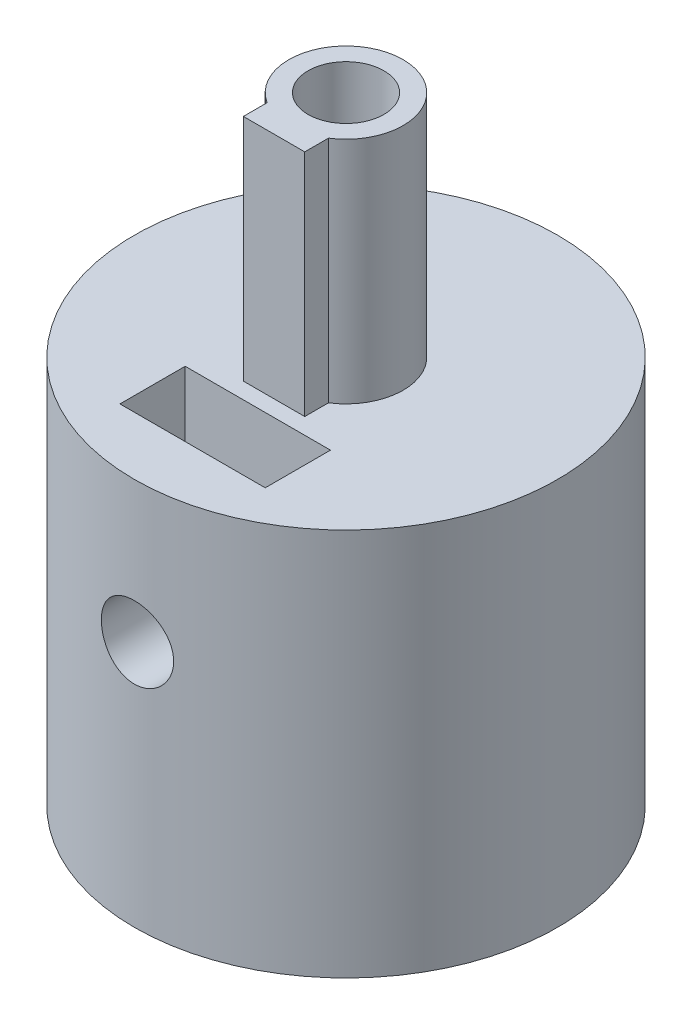
ISO-10303-21;
HEADER;
FILE_DESCRIPTION(('STEP AP214'),'2;1');
FILE_NAME('part.step','',(''),(''),'','','');
FILE_SCHEMA(('AUTOMOTIVE_DESIGN { 1 0 10303 214 1 1 1 1 }'));
ENDSEC;
DATA;
#1=APPLICATION_CONTEXT('core data for automotive mechanical design processes');
#2=APPLICATION_PROTOCOL_DEFINITION('international standard','automotive_design',2000,#1);
#3=PRODUCT_CONTEXT('',#1,'mechanical');
#4=PRODUCT('Part','Part','',(#3));
#5=PRODUCT_RELATED_PRODUCT_CATEGORY('part','',(#4));
#6=PRODUCT_DEFINITION_FORMATION('','',#4);
#7=PRODUCT_DEFINITION_CONTEXT('part definition',#1,'design');
#8=PRODUCT_DEFINITION('design','',#6,#7);
#9=PRODUCT_DEFINITION_SHAPE('','',#8);
#10=(LENGTH_UNIT() NAMED_UNIT(*) SI_UNIT(.MILLI.,.METRE.));
#11=(NAMED_UNIT(*) PLANE_ANGLE_UNIT() SI_UNIT($,.RADIAN.));
#12=(NAMED_UNIT(*) SI_UNIT($,.STERADIAN.) SOLID_ANGLE_UNIT());
#13=UNCERTAINTY_MEASURE_WITH_UNIT(LENGTH_MEASURE(1.E-05),#10,'distance_accuracy_value','');
#14=(GEOMETRIC_REPRESENTATION_CONTEXT(3) GLOBAL_UNCERTAINTY_ASSIGNED_CONTEXT((#13)) GLOBAL_UNIT_ASSIGNED_CONTEXT((#10,
#11,#12)) REPRESENTATION_CONTEXT('',''));
#15=CARTESIAN_POINT('',(0.,0.,0.));
#16=DIRECTION('',(0.,0.,1.));
#17=DIRECTION('',(1.,0.,0.));
#18=AXIS2_PLACEMENT_3D('',#15,#16,#17);
#19=CARTESIAN_POINT('',(0.,7.,6.));
#20=DIRECTION('',(0.,0.,-1.));
#21=DIRECTION('',(-1.,0.,0.));
#22=AXIS2_PLACEMENT_3D('',#19,#20,#21);
#23=CYLINDRICAL_SURFACE('',#22,1.025);
#24=CARTESIAN_POINT('',(-1.025,7.,1.8328597873269));
#25=CARTESIAN_POINT('',(-1.02499645606672,7.05360558498614,1.8328640935936));
#26=CARTESIAN_POINT('',(-1.02076698915576,7.10728326068248,1.83524689686831));
#27=CARTESIAN_POINT('',(-1.00405753177462,7.21300677697236,1.84443863790037));
#28=CARTESIAN_POINT('',(-0.991559385204819,7.26504876196016,1.85125731525541));
#29=CARTESIAN_POINT('',(-0.958969452031826,7.36577397405597,1.86834445087353));
#30=CARTESIAN_POINT('',(-0.938916546275438,7.41447291426796,1.87859521620438));
#31=CARTESIAN_POINT('',(-0.891904667350708,7.50780344562722,1.90136426661631));
#32=CARTESIAN_POINT('',(-0.86494560626241,7.55243498498397,1.91388258056418));
#33=CARTESIAN_POINT('',(-0.802406461176824,7.64023158224114,1.94097712724614));
#34=CARTESIAN_POINT('',(-0.76631621169833,7.68300737074963,1.95563775587243));
#35=CARTESIAN_POINT('',(-0.687601665544952,7.76219946830796,1.98468238424946));
#36=CARTESIAN_POINT('',(-0.644974255849895,7.79861272973073,1.99906624851168));
#37=CARTESIAN_POINT('',(-0.55108532396648,7.86630583536209,2.02702988673331));
#38=CARTESIAN_POINT('',(-0.499447438646705,7.89711293667531,2.04050061684691));
#39=CARTESIAN_POINT('',(-0.390941700361152,7.94942630968447,2.06403433745224));
#40=CARTESIAN_POINT('',(-0.334077021041106,7.97093818067812,2.0740993786814));
#41=CARTESIAN_POINT('',(-0.220850829971725,8.00252891838062,2.0890810601881));
#42=CARTESIAN_POINT('',(-0.164720524014055,8.01328866485981,2.09430254212573));
#43=CARTESIAN_POINT('',(-0.0512266882370234,8.02530565642908,2.10014221364635));
#44=CARTESIAN_POINT('',(0.00613611638643597,8.02656834386631,2.10076303966004));
#45=CARTESIAN_POINT('',(0.115373787896629,8.01983266517718,2.09748142204962));
#46=CARTESIAN_POINT('',(0.167309127918126,8.01259393861196,2.09394997215738));
#47=CARTESIAN_POINT('',(0.269118447664813,7.99041154600087,2.08331360243167));
#48=CARTESIAN_POINT('',(0.318992273374222,7.97546730539566,2.07620841612459));
#49=CARTESIAN_POINT('',(0.416153475149913,7.93818400144609,2.05895316401618));
#50=CARTESIAN_POINT('',(0.463393645521308,7.9157422120308,2.04876099467317));
#51=CARTESIAN_POINT('',(0.553555137985415,7.86423396018128,2.02626233951311));
#52=CARTESIAN_POINT('',(0.596474885223051,7.83516509459928,2.01395508711223));
#53=CARTESIAN_POINT('',(0.680950591937614,7.76817711605079,1.98706966262833));
#54=CARTESIAN_POINT('',(0.722025366910624,7.72969270677158,1.97238674800569));
#55=CARTESIAN_POINT('',(0.797390648207704,7.64648859549991,1.94314322644075));
#56=CARTESIAN_POINT('',(0.831676359665604,7.601764524395,1.92858271284636));
#57=CARTESIAN_POINT('',(0.894440298131244,7.50414319028026,1.90032382253067));
#58=CARTESIAN_POINT('',(0.922462951327314,7.45092130247636,1.88672531915229));
#59=CARTESIAN_POINT('',(0.96894590420928,7.33969400056835,1.86328435122403));
#60=CARTESIAN_POINT('',(0.987415779354138,7.28169344436965,1.8534381281014));
#61=CARTESIAN_POINT('',(1.01281094431499,7.16732297985472,1.83967626974392));
#62=CARTESIAN_POINT('',(1.02052340819776,7.11117795852812,1.83535842629193));
#63=CARTESIAN_POINT('',(1.02655429914469,6.99824263489739,1.83199386873751));
#64=CARTESIAN_POINT('',(1.02487867862491,6.94145276424609,1.8329438146448));
#65=CARTESIAN_POINT('',(1.01290336244989,6.83499386219216,1.83958207082482));
#66=CARTESIAN_POINT('',(1.00349913481734,6.78518854180321,1.84477807629652));
#67=CARTESIAN_POINT('',(0.97764080378385,6.68794853061936,1.85861017566643));
#68=CARTESIAN_POINT('',(0.961184545663605,6.64051456933413,1.8672473209342));
#69=CARTESIAN_POINT('',(0.920877212448492,6.54686680284666,1.88746229884837));
#70=CARTESIAN_POINT('',(0.896718260907304,6.50081191516395,1.8991580519879));
#71=CARTESIAN_POINT('',(0.841964328451562,6.41314809653428,1.92405824492246));
#72=CARTESIAN_POINT('',(0.811366070887821,6.37154144539512,1.93726345123587));
#73=CARTESIAN_POINT('',(0.740342279000107,6.28878007686261,1.96558410337199));
#74=CARTESIAN_POINT('',(0.699180694751609,6.24826794879975,1.98073991430063));
#75=CARTESIAN_POINT('',(0.610382766986842,6.1745372186658,2.00987952889889));
#76=CARTESIAN_POINT('',(0.562744561425935,6.14132072131622,2.02386299364009));
#77=CARTESIAN_POINT('',(0.46088365747209,6.08253549170786,2.04948776215532));
#78=CARTESIAN_POINT('',(0.406539905583027,6.05714957166641,2.06107126229387));
#79=CARTESIAN_POINT('',(0.293626072478352,6.01612584621076,2.08015652924546));
#80=CARTESIAN_POINT('',(0.235059573883659,6.0004798834219,2.08766171104581));
#81=CARTESIAN_POINT('',(0.120985244570837,5.98066877223898,2.097222972226));
#82=CARTESIAN_POINT('',(0.0656684200114449,5.97560656370893,2.09970419445187));
#83=CARTESIAN_POINT('',(-0.0450695482203042,5.97449692958199,2.10024529201488));
#84=CARTESIAN_POINT('',(-0.100490653193747,5.97844664221685,2.0983065709212));
#85=CARTESIAN_POINT('',(-0.206321200093286,5.99464010516335,2.09047330467869));
#86=CARTESIAN_POINT('',(-0.256830362999739,6.00636438807966,2.08482672187127));
#87=CARTESIAN_POINT('',(-0.355092191206429,6.03709509660264,2.07035688277301));
#88=CARTESIAN_POINT('',(-0.402844441603459,6.05610261503403,2.06153314977358));
#89=CARTESIAN_POINT('',(-0.496586623318674,6.1017440561972,2.04103045697026));
#90=CARTESIAN_POINT('',(-0.542406774569577,6.12867653213054,2.02924302326906));
#91=CARTESIAN_POINT('',(-0.629072329503909,6.18902245101638,2.00407282256472));
#92=CARTESIAN_POINT('',(-0.669915429297152,6.22243887699247,1.99068932236731));
#93=CARTESIAN_POINT('',(-0.749562379479786,6.29850472929795,1.96217008137833));
#94=CARTESIAN_POINT('',(-0.787801132441635,6.34173051599136,1.94698888727679));
#95=CARTESIAN_POINT('',(-0.856672139734532,6.43425655200169,1.91768544090081));
#96=CARTESIAN_POINT('',(-0.887298192258421,6.4835617053738,1.90356405851341));
#97=CARTESIAN_POINT('',(-0.940664590894157,6.58850827737924,1.87777865534351));
#98=CARTESIAN_POINT('',(-0.963192351888686,6.64427575689015,1.86618365252134));
#99=CARTESIAN_POINT('',(-0.998195400216386,6.75952106404816,1.84770353057538));
#100=CARTESIAN_POINT('',(-1.01070439407466,6.8189857191695,1.84080263081204));
#101=CARTESIAN_POINT('',(-1.02023257777911,6.89920162775227,1.83551880194986));
#102=CARTESIAN_POINT('',(-1.02201786408671,6.9193030196145,1.83452480173931));
#103=CARTESIAN_POINT('',(-1.0244022799265,6.95959952309683,1.83319446243567));
#104=CARTESIAN_POINT('',(-1.02500133580197,6.97979464045858,1.83285816418134));
#105=CARTESIAN_POINT('',(-1.025,7.,1.8328597873269));
#106=B_SPLINE_CURVE_WITH_KNOTS('',3,(#24,#25,#26,#27,#28,#29,#30,#31,#32,#33,#34,#35,#36,#37,
#38,#39,#40,#41,#42,#43,#44,#45,#46,#47,#48,#49,#50,#51,#52,#53,#54,#55,#56,#57,#58,#59,#60,#61,
#62,#63,#64,#65,#66,#67,#68,#69,#70,#71,#72,#73,#74,#75,#76,#77,#78,#79,#80,#81,#82,#83,#84,#85,
#86,#87,#88,#89,#90,#91,#92,#93,#94,#95,#96,#97,#98,#99,#100,#101,#102,#103,#104,#105),
.UNSPECIFIED.,.T.,.F.,(4,2,2,2,2,2,2,2,2,2,2,2,2,2,2,2,2,2,2,2,2,2,2,2,2,2,2,2,2,2,2,2,2,2,2,2,
2,2,2,2,4),(0.,0.160731801023402,0.32181770831564,0.482085661754884,0.642355655613302,
0.815190188583738,0.988107283055589,1.17200361229614,1.35578901037865,1.52701416065222,
1.69814118183609,1.85507088468206,2.01201229063649,2.17119877081237,2.33044306816614,
2.50420740726671,2.67809403541448,2.86212648314324,3.04597410221588,3.21550139929675,
3.38492122154889,3.53709084957253,3.68930700559683,3.8485908324795,4.00795590797556,
4.18627953834883,4.36465454605354,4.54692411187511,4.72904081783061,4.89496590268103,
5.06083830475238,5.216614525968,5.37241413003437,5.53506342110908,5.69778771924206,
5.87601659912541,6.05439020359654,6.23715299662205,6.41929830006472,6.47987859580963,
6.54046265305401),.UNSPECIFIED.);
#107=CARTESIAN_POINT('',(-1.025,7.,1.8328597873269));
#108=VERTEX_POINT('',#107);
#109=EDGE_CURVE('E245',#108,#108,#106,.T.);
#110=ORIENTED_EDGE('',*,*,#109,.T.);
#111=EDGE_LOOP('',(#110));
#112=FACE_BOUND('',#111,.T.);
#113=CARTESIAN_POINT('',(0.,7.,2.5));
#114=DIRECTION('',(0.,0.,1.));
#115=DIRECTION('',(1.,0.,0.));
#116=AXIS2_PLACEMENT_3D('',#113,#114,#115);
#117=CIRCLE('',#116,1.025);
#118=CARTESIAN_POINT('',(1.025,7.,2.5));
#119=VERTEX_POINT('',#118);
#120=EDGE_CURVE('E155',#119,#119,#117,.T.);
#121=ORIENTED_EDGE('',*,*,#120,.T.);
#122=EDGE_LOOP('',(#121));
#123=FACE_BOUND('',#122,.T.);
#124=ADVANCED_FACE('F50',(#112,#123),#23,.F.);
#125=CARTESIAN_POINT('',(0.,7.,4.35));
#126=DIRECTION('',(0.,0.,1.));
#127=DIRECTION('',(1.,0.,0.));
#128=AXIS2_PLACEMENT_3D('',#125,#126,#127);
#129=CIRCLE('',#128,1.025);
#130=CARTESIAN_POINT('',(1.025,7.,4.35));
#131=VERTEX_POINT('',#130);
#132=EDGE_CURVE('E187',#131,#131,#129,.T.);
#133=ORIENTED_EDGE('',*,*,#132,.F.);
#134=EDGE_LOOP('',(#133));
#135=FACE_BOUND('',#134,.T.);
#136=CARTESIAN_POINT('',(0.,5.975,6.));
#137=CARTESIAN_POINT('',(0.057129021805909,5.97500227159279,5.99999900775209));
#138=CARTESIAN_POINT('',(0.114288694426547,5.97979231886448,5.99917558388442));
#139=CARTESIAN_POINT('',(0.227003440677617,5.99881714817356,5.99597008814761));
#140=CARTESIAN_POINT('',(0.282557014382193,6.01306047901298,5.99358660551168));
#141=CARTESIAN_POINT('',(0.390412628331851,6.05054806685612,5.98752819489086));
#142=CARTESIAN_POINT('',(0.442717339459975,6.07378481362337,5.98385434470439));
#143=CARTESIAN_POINT('',(0.542679246717537,6.12857963716053,5.97561861890346));
#144=CARTESIAN_POINT('',(0.590336943676343,6.16013681583965,5.97105683914425));
#145=CARTESIAN_POINT('',(0.680135984205956,6.23101303674859,5.96149941501592));
#146=CARTESIAN_POINT('',(0.72222399560624,6.2703991817316,5.95650024504773));
#147=CARTESIAN_POINT('',(0.799228119899926,6.35567088546398,5.94665830480908));
#148=CARTESIAN_POINT('',(0.834143768661819,6.40155686450035,5.94181554467714));
#149=CARTESIAN_POINT('',(0.896027332048902,6.49889409366529,5.93280057753614));
#150=CARTESIAN_POINT('',(0.922942217268116,6.55037951664323,5.92863292447034));
#151=CARTESIAN_POINT('',(0.967721056978087,6.65722387590288,5.92148911657744));
#152=CARTESIAN_POINT('',(0.985585654718975,6.71258253657542,5.91851287707366));
#153=CARTESIAN_POINT('',(1.01158816944722,6.82503555386873,5.91412405211724));
#154=CARTESIAN_POINT('',(1.01981834503951,6.88210798803129,5.91269664496829));
#155=CARTESIAN_POINT('',(1.0266045006465,6.9968402184026,5.91152229524133));
#156=CARTESIAN_POINT('',(1.02516119995253,7.05449997062176,5.91177522771819));
#157=CARTESIAN_POINT('',(1.01271645572348,7.16810963916741,5.91391945370944));
#158=CARTESIAN_POINT('',(1.00181889187027,7.22407131955075,5.91579294055823));
#159=CARTESIAN_POINT('',(0.970938095258371,7.33336017378392,5.92093928903694));
#160=CARTESIAN_POINT('',(0.950954536531984,7.38668725303911,5.92421220087215));
#161=CARTESIAN_POINT('',(0.902364407216009,7.48950278148695,5.9318077416241));
#162=CARTESIAN_POINT('',(0.873714928690604,7.53897055247647,5.93613557261378));
#163=CARTESIAN_POINT('',(0.808636654316059,7.63243593173504,5.94534973658277));
#164=CARTESIAN_POINT('',(0.772207199569996,7.67643307618953,5.95023611685009));
#165=CARTESIAN_POINT('',(0.692038211440464,7.7583093808357,5.96009492603012));
#166=CARTESIAN_POINT('',(0.648209602257906,7.79610134182538,5.96506764647446));
#167=CARTESIAN_POINT('',(0.554787084587539,7.86380798444508,5.97448004062525));
#168=CARTESIAN_POINT('',(0.505193135382295,7.89372261043695,5.9789197105666));
#169=CARTESIAN_POINT('',(0.401564028575203,7.94483428225191,5.9867725569888));
#170=CARTESIAN_POINT('',(0.347524867685226,7.96602336454416,5.99018479500469));
#171=CARTESIAN_POINT('',(0.236583435115326,7.99900016984926,5.99559083662011));
#172=CARTESIAN_POINT('',(0.179681415700387,8.01078871966679,5.9975847649625));
#173=CARTESIAN_POINT('',(0.0653808172994139,8.0245110141699,5.99991268288137));
#174=CARTESIAN_POINT('',(0.00799700058598802,8.02656442072077,6.00026682699029));
#175=CARTESIAN_POINT('',(-0.106294577579117,8.02107753684309,5.99933056568816));
#176=CARTESIAN_POINT('',(-0.163202358214687,8.01353763491065,5.99804022687302));
#177=CARTESIAN_POINT('',(-0.274554949336556,7.98917768850822,5.99397247481089));
#178=CARTESIAN_POINT('',(-0.329013153116637,7.97241713634539,5.99120459810796));
#179=CARTESIAN_POINT('',(-0.434346698407184,7.93015526362798,5.98449086136286));
#180=CARTESIAN_POINT('',(-0.485221830138068,7.90465343180611,5.98054493241952));
#181=CARTESIAN_POINT('',(-0.582463116175228,7.84536060553919,5.97186273771382));
#182=CARTESIAN_POINT('',(-0.628783248246281,7.81149517401115,5.96711950406798));
#183=CARTESIAN_POINT('',(-0.71512583678395,7.73653853726443,5.95738922262263));
#184=CARTESIAN_POINT('',(-0.755147810705169,7.69544677889716,5.95240215617974));
#185=CARTESIAN_POINT('',(-0.828203708504392,7.60666625255827,5.94268078613609));
#186=CARTESIAN_POINT('',(-0.861156622624258,7.55891039765039,5.93794983407302));
#187=CARTESIAN_POINT('',(-0.918572497304515,7.45847068124877,5.92933984229212));
#188=CARTESIAN_POINT('',(-0.943035736678585,7.405786981665,5.92546077459866));
#189=CARTESIAN_POINT('',(-0.982657874256186,7.29720959133165,5.91901912534323));
#190=CARTESIAN_POINT('',(-0.997856483411738,7.24133073996123,5.91645093279999));
#191=CARTESIAN_POINT('',(-1.01864245502096,7.12776549602982,5.91290796951349));
#192=CARTESIAN_POINT('',(-1.02423069968971,7.07007926987783,5.91193305251065));
#193=CARTESIAN_POINT('',(-1.02561176041543,6.95534616736625,5.91169354428849));
#194=CARTESIAN_POINT('',(-1.02153213625353,6.89830083303665,5.91240668041866));
#195=CARTESIAN_POINT('',(-1.00396974898029,6.78572114096178,5.91541400302865));
#196=CARTESIAN_POINT('',(-0.990487020878766,6.73018677759163,5.91770818362188));
#197=CARTESIAN_POINT('',(-0.954550985092882,6.62225846829186,5.92361045759366));
#198=CARTESIAN_POINT('',(-0.932109203860776,6.56986058628411,5.92721686217777));
#199=CARTESIAN_POINT('',(-0.878905351085741,6.46955298770945,5.9353387767073));
#200=CARTESIAN_POINT('',(-0.848142832774206,6.42164351232635,5.93985433546496));
#201=CARTESIAN_POINT('',(-0.778717727996034,6.33102925911754,5.94935610169176));
#202=CARTESIAN_POINT('',(-0.739961482891464,6.28839676959398,5.95434747238202));
#203=CARTESIAN_POINT('',(-0.655846210332252,6.21019692843759,5.96419777785053));
#204=CARTESIAN_POINT('',(-0.610485663211635,6.17463120735148,5.96905668184154));
#205=CARTESIAN_POINT('',(-0.514055463609574,6.11133628404459,5.9781357643754));
#206=CARTESIAN_POINT('',(-0.462946585113283,6.08366612876151,5.98235102595813));
#207=CARTESIAN_POINT('',(-0.356753960873555,6.03734716959931,5.98962003307112));
#208=CARTESIAN_POINT('',(-0.301674193065421,6.01868947770605,5.99267492231261));
#209=CARTESIAN_POINT('',(-0.205324889668461,5.99492526014144,5.99662063052046));
#210=CARTESIAN_POINT('',(-0.164634720196102,5.98746540481212,5.99788104819846));
#211=CARTESIAN_POINT('',(-0.0826350389649354,5.97750199932918,5.99957108407766));
#212=CARTESIAN_POINT('',(-0.0413255387647288,5.97499835679322,6.00000071776442));
#213=CARTESIAN_POINT('',(0.,5.975,6.));
#214=B_SPLINE_CURVE_WITH_KNOTS('',3,(#136,#137,#138,#139,#140,#141,#142,#143,#144,#145,#146,
#147,#148,#149,#150,#151,#152,#153,#154,#155,#156,#157,#158,#159,#160,#161,#162,#163,#164,#165,
#166,#167,#168,#169,#170,#171,#172,#173,#174,#175,#176,#177,#178,#179,#180,#181,#182,#183,#184,
#185,#186,#187,#188,#189,#190,#191,#192,#193,#194,#195,#196,#197,#198,#199,#200,#201,#202,#203,
#204,#205,#206,#207,#208,#209,#210,#211,#212,#213),.UNSPECIFIED.,.T.,.F.,(4,2,2,2,2,2,2,2,2,2,2,
2,2,2,2,2,2,2,2,2,2,2,2,2,2,2,2,2,2,2,2,2,2,2,2,2,2,2,4),(0.,0.171235994893447,
0.342627053456379,0.513875294237686,0.685105058388228,0.857871180813245,1.03064847960544,
1.20454664979448,1.37843245841822,1.55063916189725,1.72283306073277,1.89315858532088,
2.06349022096238,2.23467942944234,2.40588314192621,2.57931792140326,2.75275392582942,
2.92634787091466,3.0999265462136,3.27136600700557,3.44279852530835,3.61313770472599,
3.78348684878489,3.95541050932786,4.12734733572354,4.30116013270972,4.4749672208821,
4.64802398347102,4.82106485889599,4.99183533604723,5.16260517738581,5.33315601574305,
5.50371601337198,5.67640118185052,5.84912614859001,6.023110871722,6.19692366051839,
6.32079330552967,6.44466064162598),.UNSPECIFIED.);
#215=CARTESIAN_POINT('',(0.,5.975,6.));
#216=VERTEX_POINT('',#215);
#217=EDGE_CURVE('E252',#216,#216,#214,.T.);
#218=ORIENTED_EDGE('',*,*,#217,.T.);
#219=EDGE_LOOP('',(#218));
#220=FACE_BOUND('',#219,.T.);
#221=ADVANCED_FACE('F263',(#135,#220),#23,.F.);
#222=CARTESIAN_POINT('',(0.,10.,0.));
#223=DIRECTION('',(0.,-1.,0.));
#224=DIRECTION('',(0.,0.,-1.));
#225=AXIS2_PLACEMENT_3D('',#222,#223,#224);
#226=CYLINDRICAL_SURFACE('',#225,6.);
#227=CARTESIAN_POINT('',(0.,0.,0.));
#228=DIRECTION('',(0.,1.,0.));
#229=DIRECTION('',(0.,0.,1.));
#230=AXIS2_PLACEMENT_3D('',#227,#228,#229);
#231=CIRCLE('',#230,6.);
#232=CARTESIAN_POINT('',(0.,0.,6.));
#233=VERTEX_POINT('',#232);
#234=EDGE_CURVE('E249',#233,#233,#231,.T.);
#235=ORIENTED_EDGE('',*,*,#234,.T.);
#236=EDGE_LOOP('',(#235));
#237=FACE_BOUND('',#236,.T.);
#238=ORIENTED_EDGE('',*,*,#217,.F.);
#239=EDGE_LOOP('',(#238));
#240=FACE_BOUND('',#239,.T.);
#241=CARTESIAN_POINT('',(0.,11.,0.));
#242=DIRECTION('',(0.,1.,0.));
#243=DIRECTION('',(0.,0.,1.));
#244=AXIS2_PLACEMENT_3D('',#241,#242,#243);
#245=CIRCLE('',#244,6.);
#246=CARTESIAN_POINT('',(0.,11.,6.));
#247=VERTEX_POINT('',#246);
#248=EDGE_CURVE('E222',#247,#247,#245,.T.);
#249=ORIENTED_EDGE('',*,*,#248,.F.);
#250=EDGE_LOOP('',(#249));
#251=FACE_BOUND('',#250,.T.);
#252=ADVANCED_FACE('F52',(#237,#240,#251),#226,.T.);
#253=CARTESIAN_POINT('',(0.,0.,0.));
#254=DIRECTION('',(0.,1.,0.));
#255=DIRECTION('',(0.,0.,1.));
#256=AXIS2_PLACEMENT_3D('',#253,#254,#255);
#257=PLANE('',#256);
#258=CARTESIAN_POINT('',(0.,0.,0.));
#259=DIRECTION('',(0.,1.,0.));
#260=DIRECTION('',(0.,0.,1.));
#261=AXIS2_PLACEMENT_3D('',#258,#259,#260);
#262=CIRCLE('',#261,2.1);
#263=CARTESIAN_POINT('',(0.,0.,2.1));
#264=VERTEX_POINT('',#263);
#265=EDGE_CURVE('E237',#264,#264,#262,.T.);
#266=ORIENTED_EDGE('',*,*,#265,.T.);
#267=EDGE_LOOP('',(#266));
#268=FACE_BOUND('',#267,.T.);
#269=ORIENTED_EDGE('',*,*,#234,.F.);
#270=EDGE_LOOP('',(#269));
#271=FACE_BOUND('',#270,.T.);
#272=ADVANCED_FACE('F270',(#268,#271),#257,.F.);
#273=CARTESIAN_POINT('',(0.,10.,0.));
#274=DIRECTION('',(0.,-1.,0.));
#275=DIRECTION('',(0.,0.,-1.));
#276=AXIS2_PLACEMENT_3D('',#273,#274,#275);
#277=CYLINDRICAL_SURFACE('',#276,2.1);
#278=DIRECTION('',(0.,-1.,0.));
#279=VECTOR('',#278,1.);
#280=CARTESIAN_POINT('',(0.475,10.,2.04557449143266));
#281=LINE('',#280,#279);
#282=CARTESIAN_POINT('',(0.475,10.,2.04557449143266));
#283=VERTEX_POINT('',#282);
#284=CARTESIAN_POINT('',(0.475,8.8,2.04557449143266));
#285=VERTEX_POINT('',#284);
#286=EDGE_CURVE('E303',#283,#285,#281,.T.);
#287=ORIENTED_EDGE('',*,*,#286,.F.);
#288=CARTESIAN_POINT('',(0.,10.,0.));
#289=DIRECTION('',(0.,1.,0.));
#290=DIRECTION('',(0.,0.,1.));
#291=AXIS2_PLACEMENT_3D('',#288,#289,#290);
#292=CIRCLE('',#291,2.1);
#293=CARTESIAN_POINT('',(0.475,10.,-2.04557449143266));
#294=VERTEX_POINT('',#293);
#295=EDGE_CURVE('E242',#283,#294,#292,.T.);
#296=ORIENTED_EDGE('',*,*,#295,.T.);
#297=DIRECTION('',(0.,-1.,0.));
#298=VECTOR('',#297,1.);
#299=CARTESIAN_POINT('',(0.475,10.,-2.04557449143266));
#300=LINE('',#299,#298);
#301=CARTESIAN_POINT('',(0.475,8.8,-2.04557449143266));
#302=VERTEX_POINT('',#301);
#303=EDGE_CURVE('E309',#302,#294,#300,.F.);
#304=ORIENTED_EDGE('',*,*,#303,.F.);
#305=CARTESIAN_POINT('',(0.,8.8,0.));
#306=DIRECTION('',(0.,-1.,0.));
#307=DIRECTION('',(0.,0.,-1.));
#308=AXIS2_PLACEMENT_3D('',#305,#306,#307);
#309=CIRCLE('',#308,2.1);
#310=CARTESIAN_POINT('',(-0.475,8.8,-2.04557449143266));
#311=VERTEX_POINT('',#310);
#312=EDGE_CURVE('E258',#311,#302,#309,.T.);
#313=ORIENTED_EDGE('',*,*,#312,.F.);
#314=DIRECTION('',(0.,-1.,0.));
#315=VECTOR('',#314,1.);
#316=CARTESIAN_POINT('',(-0.475,10.,-2.04557449143266));
#317=LINE('',#316,#315);
#318=CARTESIAN_POINT('',(-0.475,10.,-2.04557449143266));
#319=VERTEX_POINT('',#318);
#320=EDGE_CURVE('E311',#319,#311,#317,.T.);
#321=ORIENTED_EDGE('',*,*,#320,.F.);
#322=CARTESIAN_POINT('',(-0.475,10.,2.04557449143266));
#323=VERTEX_POINT('',#322);
#324=EDGE_CURVE('E246',#319,#323,#292,.T.);
#325=ORIENTED_EDGE('',*,*,#324,.T.);
#326=DIRECTION('',(0.,-1.,0.));
#327=VECTOR('',#326,1.);
#328=CARTESIAN_POINT('',(-0.475,10.,2.04557449143266));
#329=LINE('',#328,#327);
#330=CARTESIAN_POINT('',(-0.475,8.8,2.04557449143266));
#331=VERTEX_POINT('',#330);
#332=EDGE_CURVE('E306',#331,#323,#329,.F.);
#333=ORIENTED_EDGE('',*,*,#332,.F.);
#334=EDGE_CURVE('E308',#285,#331,#309,.T.);
#335=ORIENTED_EDGE('',*,*,#334,.F.);
#336=EDGE_LOOP('',(#287,#296,#304,#313,#321,#325,#333,#335));
#337=FACE_BOUND('',#336,.T.);
#338=ORIENTED_EDGE('',*,*,#109,.F.);
#339=EDGE_LOOP('',(#338));
#340=FACE_BOUND('',#339,.T.);
#341=ORIENTED_EDGE('',*,*,#265,.F.);
#342=EDGE_LOOP('',(#341));
#343=FACE_BOUND('',#342,.T.);
#344=ADVANCED_FACE('F267',(#337,#340,#343),#277,.F.);
#345=CARTESIAN_POINT('',(0.,8.8,0.));
#346=DIRECTION('',(0.,-1.,0.));
#347=DIRECTION('',(0.,0.,-1.));
#348=AXIS2_PLACEMENT_3D('',#345,#346,#347);
#349=PLANE('',#348);
#350=DIRECTION('',(0.,0.,-1.));
#351=VECTOR('',#350,1.);
#352=CARTESIAN_POINT('',(0.475,8.8,3.53457335348961));
#353=LINE('',#352,#351);
#354=EDGE_CURVE('E230',#285,#302,#353,.T.);
#355=ORIENTED_EDGE('',*,*,#354,.F.);
#356=ORIENTED_EDGE('',*,*,#334,.T.);
#357=DIRECTION('',(0.,0.,1.));
#358=VECTOR('',#357,1.);
#359=CARTESIAN_POINT('',(-0.475,8.8,3.53457335348961));
#360=LINE('',#359,#358);
#361=EDGE_CURVE('E233',#311,#331,#360,.T.);
#362=ORIENTED_EDGE('',*,*,#361,.F.);
#363=ORIENTED_EDGE('',*,*,#312,.T.);
#364=EDGE_LOOP('',(#355,#356,#362,#363));
#365=FACE_BOUND('',#364,.T.);
#366=ADVANCED_FACE('F278',(#365),#349,.T.);
#367=CARTESIAN_POINT('',(0.475,8.8,3.53457335348961));
#368=DIRECTION('',(1.,0.,0.));
#369=DIRECTION('',(0.,0.,-1.));
#370=AXIS2_PLACEMENT_3D('',#367,#368,#369);
#371=PLANE('',#370);
#372=DIRECTION('',(0.,0.,-1.));
#373=VECTOR('',#372,1.);
#374=CARTESIAN_POINT('',(0.475,10.,3.53457335348961));
#375=LINE('',#374,#373);
#376=EDGE_CURVE('E229',#283,#294,#375,.T.);
#377=ORIENTED_EDGE('',*,*,#376,.F.);
#378=ORIENTED_EDGE('',*,*,#286,.T.);
#379=ORIENTED_EDGE('',*,*,#354,.T.);
#380=ORIENTED_EDGE('',*,*,#303,.T.);
#381=EDGE_LOOP('',(#377,#378,#379,#380));
#382=FACE_BOUND('',#381,.T.);
#383=ADVANCED_FACE('F327',(#382),#371,.T.);
#384=CARTESIAN_POINT('',(-0.475,8.8,3.53457335348961));
#385=DIRECTION('',(-1.,0.,0.));
#386=DIRECTION('',(0.,0.,1.));
#387=AXIS2_PLACEMENT_3D('',#384,#385,#386);
#388=PLANE('',#387);
#389=DIRECTION('',(0.,0.,1.));
#390=VECTOR('',#389,1.);
#391=CARTESIAN_POINT('',(-0.475,10.,3.53457335348961));
#392=LINE('',#391,#390);
#393=EDGE_CURVE('E234',#319,#323,#392,.T.);
#394=ORIENTED_EDGE('',*,*,#393,.F.);
#395=ORIENTED_EDGE('',*,*,#320,.T.);
#396=ORIENTED_EDGE('',*,*,#361,.T.);
#397=ORIENTED_EDGE('',*,*,#332,.T.);
#398=EDGE_LOOP('',(#394,#395,#396,#397));
#399=FACE_BOUND('',#398,.T.);
#400=ADVANCED_FACE('F320',(#399),#388,.T.);
#401=CARTESIAN_POINT('',(0.,10.,0.));
#402=DIRECTION('',(0.,1.,0.));
#403=DIRECTION('',(0.,0.,1.));
#404=AXIS2_PLACEMENT_3D('',#401,#402,#403);
#405=PLANE('',#404);
#406=ORIENTED_EDGE('',*,*,#324,.F.);
#407=ORIENTED_EDGE('',*,*,#393,.T.);
#408=EDGE_LOOP('',(#406,#407));
#409=FACE_BOUND('',#408,.T.);
#410=ADVANCED_FACE('F331',(#409),#405,.F.);
#411=ORIENTED_EDGE('',*,*,#295,.F.);
#412=ORIENTED_EDGE('',*,*,#376,.T.);
#413=EDGE_LOOP('',(#411,#412));
#414=FACE_BOUND('',#413,.T.);
#415=ADVANCED_FACE('F329',(#414),#405,.F.);
#416=CARTESIAN_POINT('',(0.,11.,0.));
#417=DIRECTION('',(0.,1.,0.));
#418=DIRECTION('',(0.,0.,1.));
#419=AXIS2_PLACEMENT_3D('',#416,#417,#418);
#420=PLANE('',#419);
#421=DIRECTION('',(1.,0.,0.));
#422=VECTOR('',#421,1.);
#423=CARTESIAN_POINT('',(0.,11.,4.35));
#424=LINE('',#423,#422);
#425=CARTESIAN_POINT('',(-2.06,11.,4.35));
#426=VERTEX_POINT('',#425);
#427=CARTESIAN_POINT('',(2.06,11.,4.35));
#428=VERTEX_POINT('',#427);
#429=EDGE_CURVE('E12',#426,#428,#424,.T.);
#430=ORIENTED_EDGE('',*,*,#429,.F.);
#431=DIRECTION('',(0.,0.,1.));
#432=VECTOR('',#431,1.);
#433=CARTESIAN_POINT('',(-2.06,11.,0.));
#434=LINE('',#433,#432);
#435=CARTESIAN_POINT('',(-2.06,11.,2.5));
#436=VERTEX_POINT('',#435);
#437=EDGE_CURVE('E59',#436,#426,#434,.T.);
#438=ORIENTED_EDGE('',*,*,#437,.F.);
#439=DIRECTION('',(1.,0.,0.));
#440=VECTOR('',#439,1.);
#441=CARTESIAN_POINT('',(0.,11.,2.5));
#442=LINE('',#441,#440);
#443=CARTESIAN_POINT('',(2.06,11.,2.5));
#444=VERTEX_POINT('',#443);
#445=EDGE_CURVE('E295',#436,#444,#442,.T.);
#446=ORIENTED_EDGE('',*,*,#445,.T.);
#447=DIRECTION('',(0.,0.,1.));
#448=VECTOR('',#447,1.);
#449=CARTESIAN_POINT('',(2.06,11.,0.));
#450=LINE('',#449,#448);
#451=EDGE_CURVE('E299',#444,#428,#450,.T.);
#452=ORIENTED_EDGE('',*,*,#451,.T.);
#453=EDGE_LOOP('',(#430,#438,#446,#452));
#454=FACE_BOUND('',#453,.T.);
#455=DIRECTION('',(0.,0.,1.));
#456=VECTOR('',#455,1.);
#457=CARTESIAN_POINT('',(-0.87,11.,0.));
#458=LINE('',#457,#456);
#459=CARTESIAN_POINT('',(-0.87,11.,1.36656503687165));
#460=VERTEX_POINT('',#459);
#461=CARTESIAN_POINT('',(-0.87,11.,2.04));
#462=VERTEX_POINT('',#461);
#463=EDGE_CURVE('E74',#460,#462,#458,.T.);
#464=ORIENTED_EDGE('',*,*,#463,.F.);
#465=CARTESIAN_POINT('',(0.,11.,0.));
#466=DIRECTION('',(0.,1.,0.));
#467=DIRECTION('',(0.,0.,1.));
#468=AXIS2_PLACEMENT_3D('',#465,#466,#467);
#469=CIRCLE('',#468,1.62);
#470=CARTESIAN_POINT('',(0.87,11.,1.36656503687165));
#471=VERTEX_POINT('',#470);
#472=EDGE_CURVE('E194',#471,#460,#469,.T.);
#473=ORIENTED_EDGE('',*,*,#472,.F.);
#474=DIRECTION('',(0.,0.,1.));
#475=VECTOR('',#474,1.);
#476=CARTESIAN_POINT('',(0.87,11.,0.));
#477=LINE('',#476,#475);
#478=CARTESIAN_POINT('',(0.87,11.,2.04));
#479=VERTEX_POINT('',#478);
#480=EDGE_CURVE('E200',#471,#479,#477,.T.);
#481=ORIENTED_EDGE('',*,*,#480,.T.);
#482=DIRECTION('',(1.,0.,0.));
#483=VECTOR('',#482,1.);
#484=CARTESIAN_POINT('',(0.,11.,2.04));
#485=LINE('',#484,#483);
#486=EDGE_CURVE('E207',#462,#479,#485,.T.);
#487=ORIENTED_EDGE('',*,*,#486,.F.);
#488=EDGE_LOOP('',(#464,#473,#481,#487));
#489=FACE_BOUND('',#488,.T.);
#490=ORIENTED_EDGE('',*,*,#248,.T.);
#491=EDGE_LOOP('',(#490));
#492=FACE_BOUND('',#491,.T.);
#493=ADVANCED_FACE('F297',(#454,#489,#492),#420,.T.);
#494=CARTESIAN_POINT('',(-0.87,17.5,0.));
#495=DIRECTION('',(1.,0.,0.));
#496=DIRECTION('',(0.,0.,-1.));
#497=AXIS2_PLACEMENT_3D('',#494,#495,#496);
#498=PLANE('',#497);
#499=ORIENTED_EDGE('',*,*,#463,.T.);
#500=DIRECTION('',(0.,-1.,0.));
#501=VECTOR('',#500,1.);
#502=CARTESIAN_POINT('',(-0.87,17.5,2.04));
#503=LINE('',#502,#501);
#504=CARTESIAN_POINT('',(-0.87,17.5,2.04));
#505=VERTEX_POINT('',#504);
#506=EDGE_CURVE('E217',#505,#462,#503,.T.);
#507=ORIENTED_EDGE('',*,*,#506,.F.);
#508=DIRECTION('',(0.,0.,1.));
#509=VECTOR('',#508,1.);
#510=CARTESIAN_POINT('',(-0.87,17.5,0.));
#511=LINE('',#510,#509);
#512=CARTESIAN_POINT('',(-0.87,17.5,1.36656503687165));
#513=VERTEX_POINT('',#512);
#514=EDGE_CURVE('E197',#513,#505,#511,.T.);
#515=ORIENTED_EDGE('',*,*,#514,.F.);
#516=DIRECTION('',(0.,-1.,0.));
#517=VECTOR('',#516,1.);
#518=CARTESIAN_POINT('',(-0.87,17.5,1.36656503687165));
#519=LINE('',#518,#517);
#520=EDGE_CURVE('E220',#513,#460,#519,.T.);
#521=ORIENTED_EDGE('',*,*,#520,.T.);
#522=EDGE_LOOP('',(#499,#507,#515,#521));
#523=FACE_BOUND('',#522,.T.);
#524=ADVANCED_FACE('F337',(#523),#498,.F.);
#525=CARTESIAN_POINT('',(0.,17.5,2.04));
#526=DIRECTION('',(0.,0.,-1.));
#527=DIRECTION('',(-1.,0.,0.));
#528=AXIS2_PLACEMENT_3D('',#525,#526,#527);
#529=PLANE('',#528);
#530=ORIENTED_EDGE('',*,*,#486,.T.);
#531=DIRECTION('',(0.,-1.,0.));
#532=VECTOR('',#531,1.);
#533=CARTESIAN_POINT('',(0.87,17.5,2.04));
#534=LINE('',#533,#532);
#535=CARTESIAN_POINT('',(0.87,17.5,2.04));
#536=VERTEX_POINT('',#535);
#537=EDGE_CURVE('E214',#536,#479,#534,.T.);
#538=ORIENTED_EDGE('',*,*,#537,.F.);
#539=DIRECTION('',(1.,0.,0.));
#540=VECTOR('',#539,1.);
#541=CARTESIAN_POINT('',(0.,17.5,2.04));
#542=LINE('',#541,#540);
#543=EDGE_CURVE('E199',#505,#536,#542,.T.);
#544=ORIENTED_EDGE('',*,*,#543,.F.);
#545=ORIENTED_EDGE('',*,*,#506,.T.);
#546=EDGE_LOOP('',(#530,#538,#544,#545));
#547=FACE_BOUND('',#546,.T.);
#548=ADVANCED_FACE('F374',(#547),#529,.F.);
#549=CARTESIAN_POINT('',(0.87,17.5,0.));
#550=DIRECTION('',(1.,0.,0.));
#551=DIRECTION('',(0.,0.,-1.));
#552=AXIS2_PLACEMENT_3D('',#549,#550,#551);
#553=PLANE('',#552);
#554=ORIENTED_EDGE('',*,*,#480,.F.);
#555=DIRECTION('',(0.,-1.,0.));
#556=VECTOR('',#555,1.);
#557=CARTESIAN_POINT('',(0.87,17.5,1.36656503687165));
#558=LINE('',#557,#556);
#559=CARTESIAN_POINT('',(0.87,17.5,1.36656503687165));
#560=VERTEX_POINT('',#559);
#561=EDGE_CURVE('E205',#560,#471,#558,.T.);
#562=ORIENTED_EDGE('',*,*,#561,.F.);
#563=DIRECTION('',(0.,0.,1.));
#564=VECTOR('',#563,1.);
#565=CARTESIAN_POINT('',(0.87,17.5,0.));
#566=LINE('',#565,#564);
#567=EDGE_CURVE('E202',#560,#536,#566,.T.);
#568=ORIENTED_EDGE('',*,*,#567,.T.);
#569=ORIENTED_EDGE('',*,*,#537,.T.);
#570=EDGE_LOOP('',(#554,#562,#568,#569));
#571=FACE_BOUND('',#570,.T.);
#572=ADVANCED_FACE('F384',(#571),#553,.T.);
#573=CARTESIAN_POINT('',(0.,17.5,0.));
#574=DIRECTION('',(0.,1.,0.));
#575=DIRECTION('',(0.,0.,1.));
#576=AXIS2_PLACEMENT_3D('',#573,#574,#575);
#577=PLANE('',#576);
#578=CARTESIAN_POINT('',(0.,17.5,0.));
#579=DIRECTION('',(0.,1.,0.));
#580=DIRECTION('',(0.,0.,1.));
#581=AXIS2_PLACEMENT_3D('',#578,#579,#580);
#582=CIRCLE('',#581,1.075);
#583=CARTESIAN_POINT('',(0.,17.5,1.075));
#584=VERTEX_POINT('',#583);
#585=EDGE_CURVE('E190',#584,#584,#582,.T.);
#586=ORIENTED_EDGE('',*,*,#585,.F.);
#587=EDGE_LOOP('',(#586));
#588=FACE_BOUND('',#587,.T.);
#589=ORIENTED_EDGE('',*,*,#567,.F.);
#590=CARTESIAN_POINT('',(0.,17.5,0.));
#591=DIRECTION('',(0.,1.,0.));
#592=DIRECTION('',(0.,0.,1.));
#593=AXIS2_PLACEMENT_3D('',#590,#591,#592);
#594=CIRCLE('',#593,1.62);
#595=EDGE_CURVE('E208',#560,#513,#594,.T.);
#596=ORIENTED_EDGE('',*,*,#595,.T.);
#597=ORIENTED_EDGE('',*,*,#514,.T.);
#598=ORIENTED_EDGE('',*,*,#543,.T.);
#599=EDGE_LOOP('',(#589,#596,#597,#598));
#600=FACE_BOUND('',#599,.T.);
#601=ADVANCED_FACE('F394',(#588,#600),#577,.T.);
#602=CARTESIAN_POINT('',(0.,17.5,0.));
#603=DIRECTION('',(0.,-1.,0.));
#604=DIRECTION('',(0.,0.,-1.));
#605=AXIS2_PLACEMENT_3D('',#602,#603,#604);
#606=CYLINDRICAL_SURFACE('',#605,1.62);
#607=ORIENTED_EDGE('',*,*,#472,.T.);
#608=ORIENTED_EDGE('',*,*,#520,.F.);
#609=ORIENTED_EDGE('',*,*,#595,.F.);
#610=ORIENTED_EDGE('',*,*,#561,.T.);
#611=EDGE_LOOP('',(#607,#608,#609,#610));
#612=FACE_BOUND('',#611,.T.);
#613=ADVANCED_FACE('F402',(#612),#606,.T.);
#614=CARTESIAN_POINT('',(0.,11.5,0.));
#615=DIRECTION('',(0.,1.,0.));
#616=DIRECTION('',(0.,0.,1.));
#617=AXIS2_PLACEMENT_3D('',#614,#615,#616);
#618=CYLINDRICAL_SURFACE('',#617,1.075);
#619=CARTESIAN_POINT('',(0.,11.5,0.));
#620=DIRECTION('',(0.,1.,0.));
#621=DIRECTION('',(0.,0.,1.));
#622=AXIS2_PLACEMENT_3D('',#619,#620,#621);
#623=CIRCLE('',#622,1.075);
#624=CARTESIAN_POINT('',(0.,11.5,1.075));
#625=VERTEX_POINT('',#624);
#626=EDGE_CURVE('E191',#625,#625,#623,.T.);
#627=ORIENTED_EDGE('',*,*,#626,.F.);
#628=EDGE_LOOP('',(#627));
#629=FACE_BOUND('',#628,.T.);
#630=ORIENTED_EDGE('',*,*,#585,.T.);
#631=EDGE_LOOP('',(#630));
#632=FACE_BOUND('',#631,.T.);
#633=ADVANCED_FACE('F407',(#629,#632),#618,.F.);
#634=CARTESIAN_POINT('',(0.,11.5,0.));
#635=DIRECTION('',(0.,1.,0.));
#636=DIRECTION('',(0.,0.,1.));
#637=AXIS2_PLACEMENT_3D('',#634,#635,#636);
#638=PLANE('',#637);
#639=ORIENTED_EDGE('',*,*,#626,.T.);
#640=EDGE_LOOP('',(#639));
#641=FACE_BOUND('',#640,.T.);
#642=ADVANCED_FACE('F424',(#641),#638,.T.);
#643=CARTESIAN_POINT('',(-2.06,0.,4.35));
#644=DIRECTION('',(-1.,0.,0.));
#645=DIRECTION('',(0.,-1.,0.));
#646=AXIS2_PLACEMENT_3D('',#643,#644,#645);
#647=PLANE('',#646);
#648=ORIENTED_EDGE('',*,*,#437,.T.);
#649=DIRECTION('',(0.,1.,0.));
#650=VECTOR('',#649,1.);
#651=CARTESIAN_POINT('',(-2.06,0.,4.35));
#652=LINE('',#651,#650);
#653=CARTESIAN_POINT('',(-2.06,5.81065844546937,4.35));
#654=VERTEX_POINT('',#653);
#655=EDGE_CURVE('E162',#654,#426,#652,.T.);
#656=ORIENTED_EDGE('',*,*,#655,.F.);
#657=DIRECTION('',(0.,0.,-1.));
#658=VECTOR('',#657,1.);
#659=CARTESIAN_POINT('',(-2.06,5.81065844546937,4.35));
#660=LINE('',#659,#658);
#661=CARTESIAN_POINT('',(-2.06,5.81065844546937,2.5));
#662=VERTEX_POINT('',#661);
#663=EDGE_CURVE('E144',#654,#662,#660,.T.);
#664=ORIENTED_EDGE('',*,*,#663,.T.);
#665=DIRECTION('',(0.,1.,0.));
#666=VECTOR('',#665,1.);
#667=CARTESIAN_POINT('',(-2.06,0.,2.5));
#668=LINE('',#667,#666);
#669=EDGE_CURVE('E178',#662,#436,#668,.T.);
#670=ORIENTED_EDGE('',*,*,#669,.T.);
#671=EDGE_LOOP('',(#648,#656,#664,#670));
#672=FACE_BOUND('',#671,.T.);
#673=ADVANCED_FACE('F167',(#672),#647,.F.);
#674=CARTESIAN_POINT('',(2.00108891324554,3.46598766820406,4.35));
#675=DIRECTION('',(0.499999999999999,0.866025403784439,0.));
#676=DIRECTION('',(-0.866025403784439,0.499999999999999,0.));
#677=AXIS2_PLACEMENT_3D('',#674,#675,#676);
#678=PLANE('',#677);
#679=DIRECTION('',(0.866025403784439,-0.5,0.));
#680=VECTOR('',#679,1.);
#681=CARTESIAN_POINT('',(2.00108891324554,3.46598766820406,2.5));
#682=LINE('',#681,#680);
#683=CARTESIAN_POINT('',(0.,4.62131689093875,2.5));
#684=VERTEX_POINT('',#683);
#685=EDGE_CURVE('E150',#662,#684,#682,.T.);
#686=ORIENTED_EDGE('',*,*,#685,.F.);
#687=ORIENTED_EDGE('',*,*,#663,.F.);
#688=DIRECTION('',(0.866025403784439,-0.5,0.));
#689=VECTOR('',#688,1.);
#690=CARTESIAN_POINT('',(2.00108891324554,3.46598766820406,4.35));
#691=LINE('',#690,#689);
#692=CARTESIAN_POINT('',(0.,4.62131689093875,4.35));
#693=VERTEX_POINT('',#692);
#694=EDGE_CURVE('E148',#654,#693,#691,.T.);
#695=ORIENTED_EDGE('',*,*,#694,.T.);
#696=DIRECTION('',(0.,0.,-1.));
#697=VECTOR('',#696,1.);
#698=CARTESIAN_POINT('',(0.,4.62131689093875,4.35));
#699=LINE('',#698,#697);
#700=EDGE_CURVE('E156',#693,#684,#699,.T.);
#701=ORIENTED_EDGE('',*,*,#700,.T.);
#702=EDGE_LOOP('',(#686,#687,#695,#701));
#703=FACE_BOUND('',#702,.T.);
#704=ADVANCED_FACE('F146',(#703),#678,.T.);
#705=CARTESIAN_POINT('',(-2.00108891324554,3.46598766820406,4.35));
#706=DIRECTION('',(-0.5,0.866025403784439,0.));
#707=DIRECTION('',(-0.866025403784439,-0.5,0.));
#708=AXIS2_PLACEMENT_3D('',#705,#706,#707);
#709=PLANE('',#708);
#710=DIRECTION('',(0.866025403784439,0.5,0.));
#711=VECTOR('',#710,1.);
#712=CARTESIAN_POINT('',(-2.00108891324554,3.46598766820406,2.5));
#713=LINE('',#712,#711);
#714=CARTESIAN_POINT('',(2.06,5.81065844546937,2.5));
#715=VERTEX_POINT('',#714);
#716=EDGE_CURVE('E170',#684,#715,#713,.T.);
#717=ORIENTED_EDGE('',*,*,#716,.F.);
#718=ORIENTED_EDGE('',*,*,#700,.F.);
#719=DIRECTION('',(0.866025403784439,0.5,0.));
#720=VECTOR('',#719,1.);
#721=CARTESIAN_POINT('',(-2.00108891324554,3.46598766820406,4.35));
#722=LINE('',#721,#720);
#723=CARTESIAN_POINT('',(2.06,5.81065844546937,4.35));
#724=VERTEX_POINT('',#723);
#725=EDGE_CURVE('E165',#693,#724,#722,.T.);
#726=ORIENTED_EDGE('',*,*,#725,.T.);
#727=DIRECTION('',(0.,0.,-1.));
#728=VECTOR('',#727,1.);
#729=CARTESIAN_POINT('',(2.06,5.81065844546937,4.35));
#730=LINE('',#729,#728);
#731=EDGE_CURVE('E177',#724,#715,#730,.T.);
#732=ORIENTED_EDGE('',*,*,#731,.T.);
#733=EDGE_LOOP('',(#717,#718,#726,#732));
#734=FACE_BOUND('',#733,.T.);
#735=ADVANCED_FACE('F469',(#734),#709,.T.);
#736=CARTESIAN_POINT('',(2.06,0.,4.35));
#737=DIRECTION('',(-1.,0.,0.));
#738=DIRECTION('',(0.,0.,1.));
#739=AXIS2_PLACEMENT_3D('',#736,#737,#738);
#740=PLANE('',#739);
#741=DIRECTION('',(0.,1.,0.));
#742=VECTOR('',#741,1.);
#743=CARTESIAN_POINT('',(2.06,0.,2.5));
#744=LINE('',#743,#742);
#745=EDGE_CURVE('E66',#715,#444,#744,.T.);
#746=ORIENTED_EDGE('',*,*,#745,.F.);
#747=ORIENTED_EDGE('',*,*,#731,.F.);
#748=DIRECTION('',(0.,1.,0.));
#749=VECTOR('',#748,1.);
#750=CARTESIAN_POINT('',(2.06,0.,4.35));
#751=LINE('',#750,#749);
#752=EDGE_CURVE('E174',#724,#428,#751,.T.);
#753=ORIENTED_EDGE('',*,*,#752,.T.);
#754=ORIENTED_EDGE('',*,*,#451,.F.);
#755=EDGE_LOOP('',(#746,#747,#753,#754));
#756=FACE_BOUND('',#755,.T.);
#757=ADVANCED_FACE('F478',(#756),#740,.T.);
#758=CARTESIAN_POINT('',(0.,0.,4.35));
#759=DIRECTION('',(0.,0.,1.));
#760=DIRECTION('',(1.,0.,0.));
#761=AXIS2_PLACEMENT_3D('',#758,#759,#760);
#762=PLANE('',#761);
#763=ORIENTED_EDGE('',*,*,#132,.T.);
#764=EDGE_LOOP('',(#763));
#765=FACE_BOUND('',#764,.T.);
#766=ORIENTED_EDGE('',*,*,#429,.T.);
#767=ORIENTED_EDGE('',*,*,#752,.F.);
#768=ORIENTED_EDGE('',*,*,#725,.F.);
#769=ORIENTED_EDGE('',*,*,#694,.F.);
#770=ORIENTED_EDGE('',*,*,#655,.T.);
#771=EDGE_LOOP('',(#766,#767,#768,#769,#770));
#772=FACE_BOUND('',#771,.T.);
#773=ADVANCED_FACE('F161',(#765,#772),#762,.F.);
#774=CARTESIAN_POINT('',(0.,0.,2.5));
#775=DIRECTION('',(0.,0.,1.));
#776=DIRECTION('',(1.,0.,0.));
#777=AXIS2_PLACEMENT_3D('',#774,#775,#776);
#778=PLANE('',#777);
#779=ORIENTED_EDGE('',*,*,#120,.F.);
#780=EDGE_LOOP('',(#779));
#781=FACE_BOUND('',#780,.T.);
#782=ORIENTED_EDGE('',*,*,#669,.F.);
#783=ORIENTED_EDGE('',*,*,#685,.T.);
#784=ORIENTED_EDGE('',*,*,#716,.T.);
#785=ORIENTED_EDGE('',*,*,#745,.T.);
#786=ORIENTED_EDGE('',*,*,#445,.F.);
#787=EDGE_LOOP('',(#782,#783,#784,#785,#786));
#788=FACE_BOUND('',#787,.T.);
#789=ADVANCED_FACE('F291',(#781,#788),#778,.T.);
#790=CLOSED_SHELL('',(#124,#221,#252,#272,#344,#366,#383,#400,#410,#415,#493,#524,#548,#572,
#601,#613,#633,#642,#673,#704,#735,#757,#773,#789));
#791=MANIFOLD_SOLID_BREP('B2',#790);
#792=ADVANCED_BREP_SHAPE_REPRESENTATION('',(#18,#791),#14);
#793=SHAPE_DEFINITION_REPRESENTATION(#9,#792);
ENDSEC;
END-ISO-10303-21;
